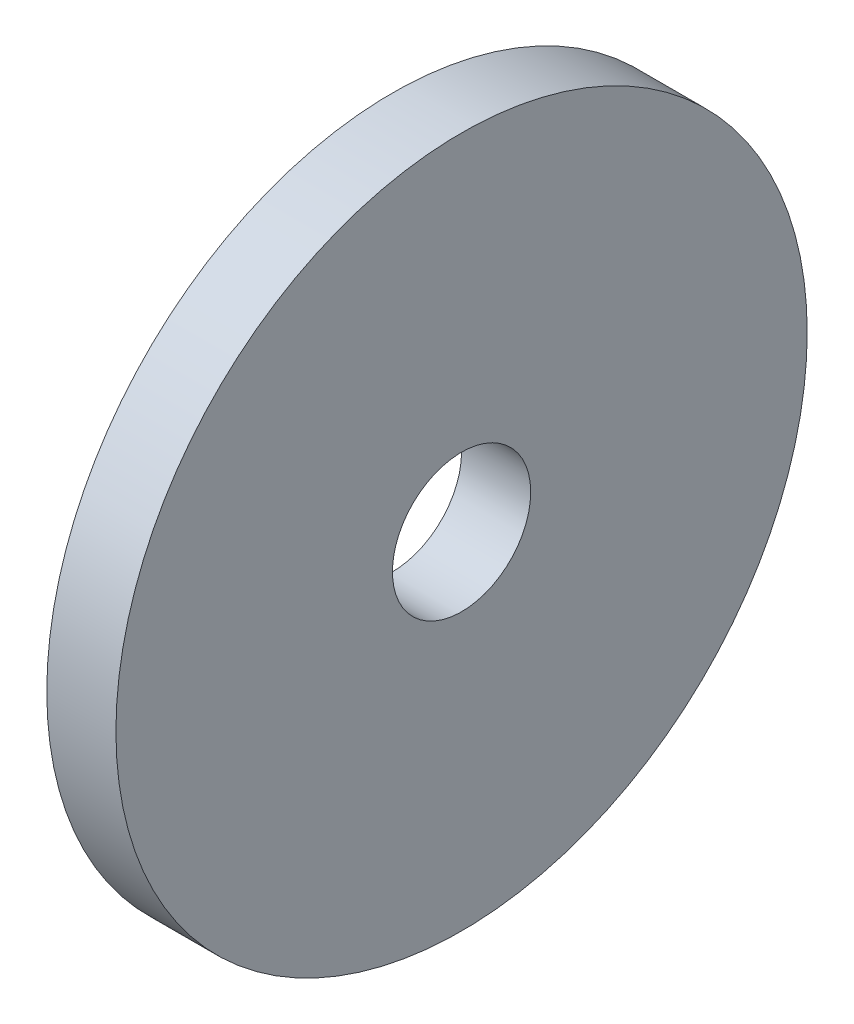
ISO-10303-21;
HEADER;
FILE_DESCRIPTION(('STEP AP214'),'2;1');
FILE_NAME('part.step','',(''),(''),'','','');
FILE_SCHEMA(('AUTOMOTIVE_DESIGN { 1 0 10303 214 1 1 1 1 }'));
ENDSEC;
DATA;
#1=APPLICATION_CONTEXT('core data for automotive mechanical design processes');
#2=APPLICATION_PROTOCOL_DEFINITION('international standard','automotive_design',2000,#1);
#3=PRODUCT_CONTEXT('',#1,'mechanical');
#4=PRODUCT('Part','Part','',(#3));
#5=PRODUCT_RELATED_PRODUCT_CATEGORY('part','',(#4));
#6=PRODUCT_DEFINITION_FORMATION('','',#4);
#7=PRODUCT_DEFINITION_CONTEXT('part definition',#1,'design');
#8=PRODUCT_DEFINITION('design','',#6,#7);
#9=PRODUCT_DEFINITION_SHAPE('','',#8);
#10=(LENGTH_UNIT() NAMED_UNIT(*) SI_UNIT(.MILLI.,.METRE.));
#11=(NAMED_UNIT(*) PLANE_ANGLE_UNIT() SI_UNIT($,.RADIAN.));
#12=(NAMED_UNIT(*) SI_UNIT($,.STERADIAN.) SOLID_ANGLE_UNIT());
#13=UNCERTAINTY_MEASURE_WITH_UNIT(LENGTH_MEASURE(1.E-05),#10,'distance_accuracy_value','');
#14=(GEOMETRIC_REPRESENTATION_CONTEXT(3) GLOBAL_UNCERTAINTY_ASSIGNED_CONTEXT((#13)) GLOBAL_UNIT_ASSIGNED_CONTEXT((#10,
#11,#12)) REPRESENTATION_CONTEXT('',''));
#15=CARTESIAN_POINT('',(0.,0.,0.));
#16=DIRECTION('',(0.,0.,1.));
#17=DIRECTION('',(1.,0.,0.));
#18=AXIS2_PLACEMENT_3D('',#15,#16,#17);
#19=CARTESIAN_POINT('',(2.,0.,0.));
#20=DIRECTION('',(-1.,0.,0.));
#21=DIRECTION('',(0.,0.,1.));
#22=AXIS2_PLACEMENT_3D('',#19,#20,#21);
#23=CYLINDRICAL_SURFACE('',#22,10.);
#24=CARTESIAN_POINT('',(2.,0.,0.));
#25=DIRECTION('',(1.,0.,0.));
#26=DIRECTION('',(0.,0.,-1.));
#27=AXIS2_PLACEMENT_3D('',#24,#25,#26);
#28=CIRCLE('',#27,10.);
#29=CARTESIAN_POINT('',(2.,0.,-10.));
#30=VERTEX_POINT('',#29);
#31=EDGE_CURVE('E10',#30,#30,#28,.T.);
#32=ORIENTED_EDGE('',*,*,#31,.F.);
#33=EDGE_LOOP('',(#32));
#34=FACE_BOUND('',#33,.T.);
#35=CARTESIAN_POINT('',(0.,0.,0.));
#36=DIRECTION('',(1.,0.,0.));
#37=DIRECTION('',(0.,0.,-1.));
#38=AXIS2_PLACEMENT_3D('',#35,#36,#37);
#39=CIRCLE('',#38,10.);
#40=CARTESIAN_POINT('',(0.,0.,-10.));
#41=VERTEX_POINT('',#40);
#42=EDGE_CURVE('E34',#41,#41,#39,.T.);
#43=ORIENTED_EDGE('',*,*,#42,.T.);
#44=EDGE_LOOP('',(#43));
#45=FACE_BOUND('',#44,.T.);
#46=ADVANCED_FACE('F31',(#34,#45),#23,.T.);
#47=CARTESIAN_POINT('',(2.,0.,0.));
#48=DIRECTION('',(1.,0.,0.));
#49=DIRECTION('',(0.,0.,-1.));
#50=AXIS2_PLACEMENT_3D('',#47,#48,#49);
#51=PLANE('',#50);
#52=CARTESIAN_POINT('',(2.,0.,0.));
#53=DIRECTION('',(1.,0.,0.));
#54=DIRECTION('',(0.,0.,-1.));
#55=AXIS2_PLACEMENT_3D('',#52,#53,#54);
#56=CIRCLE('',#55,2.);
#57=CARTESIAN_POINT('',(2.,0.,-2.));
#58=VERTEX_POINT('',#57);
#59=EDGE_CURVE('E43',#58,#58,#56,.T.);
#60=ORIENTED_EDGE('',*,*,#59,.F.);
#61=EDGE_LOOP('',(#60));
#62=FACE_BOUND('',#61,.T.);
#63=ORIENTED_EDGE('',*,*,#31,.T.);
#64=EDGE_LOOP('',(#63));
#65=FACE_BOUND('',#64,.T.);
#66=ADVANCED_FACE('F58',(#62,#65),#51,.T.);
#67=CARTESIAN_POINT('',(0.,0.,0.));
#68=DIRECTION('',(1.,0.,0.));
#69=DIRECTION('',(0.,0.,-1.));
#70=AXIS2_PLACEMENT_3D('',#67,#68,#69);
#71=PLANE('',#70);
#72=CARTESIAN_POINT('',(0.,0.,0.));
#73=DIRECTION('',(1.,0.,0.));
#74=DIRECTION('',(0.,0.,-1.));
#75=AXIS2_PLACEMENT_3D('',#72,#73,#74);
#76=CIRCLE('',#75,2.);
#77=CARTESIAN_POINT('',(0.,0.,-2.));
#78=VERTEX_POINT('',#77);
#79=EDGE_CURVE('E41',#78,#78,#76,.T.);
#80=ORIENTED_EDGE('',*,*,#79,.T.);
#81=EDGE_LOOP('',(#80));
#82=FACE_BOUND('',#81,.T.);
#83=ORIENTED_EDGE('',*,*,#42,.F.);
#84=EDGE_LOOP('',(#83));
#85=FACE_BOUND('',#84,.T.);
#86=ADVANCED_FACE('F49',(#82,#85),#71,.F.);
#87=CARTESIAN_POINT('',(0.,0.,0.));
#88=DIRECTION('',(1.,0.,0.));
#89=DIRECTION('',(0.,0.,-1.));
#90=AXIS2_PLACEMENT_3D('',#87,#88,#89);
#91=CYLINDRICAL_SURFACE('',#90,2.);
#92=ORIENTED_EDGE('',*,*,#79,.F.);
#93=EDGE_LOOP('',(#92));
#94=FACE_BOUND('',#93,.T.);
#95=ORIENTED_EDGE('',*,*,#59,.T.);
#96=EDGE_LOOP('',(#95));
#97=FACE_BOUND('',#96,.T.);
#98=ADVANCED_FACE('F52',(#94,#97),#91,.F.);
#99=CLOSED_SHELL('',(#46,#66,#86,#98));
#100=MANIFOLD_SOLID_BREP('B2',#99);
#101=ADVANCED_BREP_SHAPE_REPRESENTATION('',(#18,#100),#14);
#102=SHAPE_DEFINITION_REPRESENTATION(#9,#101);
ENDSEC;
END-ISO-10303-21;
